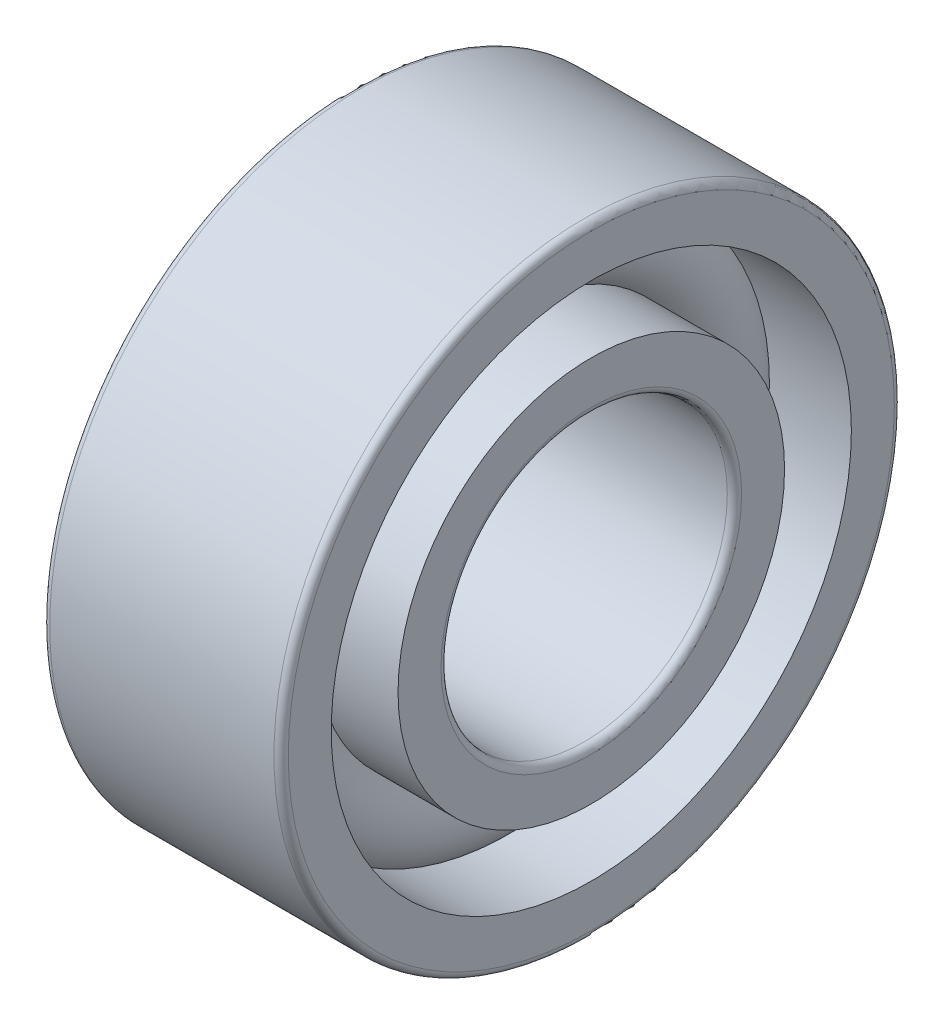
ISO-10303-21;
HEADER;
FILE_DESCRIPTION(('STEP AP214'),'2;1');
FILE_NAME('part.step','',(''),(''),'','','');
FILE_SCHEMA(('AUTOMOTIVE_DESIGN { 1 0 10303 214 1 1 1 1 }'));
ENDSEC;
DATA;
#1=APPLICATION_CONTEXT('core data for automotive mechanical design processes');
#2=APPLICATION_PROTOCOL_DEFINITION('international standard','automotive_design',2000,#1);
#3=PRODUCT_CONTEXT('',#1,'mechanical');
#4=PRODUCT('Part','Part','',(#3));
#5=PRODUCT_RELATED_PRODUCT_CATEGORY('part','',(#4));
#6=PRODUCT_DEFINITION_FORMATION('','',#4);
#7=PRODUCT_DEFINITION_CONTEXT('part definition',#1,'design');
#8=PRODUCT_DEFINITION('design','',#6,#7);
#9=PRODUCT_DEFINITION_SHAPE('','',#8);
#10=(LENGTH_UNIT() NAMED_UNIT(*) SI_UNIT(.MILLI.,.METRE.));
#11=(NAMED_UNIT(*) PLANE_ANGLE_UNIT() SI_UNIT($,.RADIAN.));
#12=(NAMED_UNIT(*) SI_UNIT($,.STERADIAN.) SOLID_ANGLE_UNIT());
#13=UNCERTAINTY_MEASURE_WITH_UNIT(LENGTH_MEASURE(1.E-05),#10,'distance_accuracy_value','');
#14=(GEOMETRIC_REPRESENTATION_CONTEXT(3) GLOBAL_UNCERTAINTY_ASSIGNED_CONTEXT((#13)) GLOBAL_UNIT_ASSIGNED_CONTEXT((#10,
#11,#12)) REPRESENTATION_CONTEXT('',''));
#15=CARTESIAN_POINT('',(0.,0.,0.));
#16=DIRECTION('',(0.,0.,1.));
#17=DIRECTION('',(1.,0.,0.));
#18=AXIS2_PLACEMENT_3D('',#15,#16,#17);
#19=CARTESIAN_POINT('',(0.,0.,0.));
#20=DIRECTION('',(-1.,0.,0.));
#21=DIRECTION('',(0.,0.,1.));
#22=AXIS2_PLACEMENT_3D('',#19,#20,#21);
#23=TOROIDAL_SURFACE('',#22,4.75,1.05);
#24=CARTESIAN_POINT('',(0.782623792124923,0.,0.));
#25=DIRECTION('',(-1.,0.,0.));
#26=DIRECTION('',(0.,0.,1.));
#27=AXIS2_PLACEMENT_3D('',#24,#25,#26);
#28=CIRCLE('',#27,5.45000000000001);
#29=CARTESIAN_POINT('',(0.782623792124923,0.,5.45000000000001));
#30=VERTEX_POINT('',#29);
#31=EDGE_CURVE('E35',#30,#30,#28,.F.);
#32=ORIENTED_EDGE('',*,*,#31,.T.);
#33=EDGE_LOOP('',(#32));
#34=FACE_BOUND('',#33,.T.);
#35=CARTESIAN_POINT('',(0.782623792124924,0.,0.));
#36=DIRECTION('',(-1.,0.,0.));
#37=DIRECTION('',(0.,0.,1.));
#38=AXIS2_PLACEMENT_3D('',#35,#36,#37);
#39=CIRCLE('',#38,4.05);
#40=CARTESIAN_POINT('',(0.782623792124924,0.,4.05));
#41=VERTEX_POINT('',#40);
#42=EDGE_CURVE('E10',#41,#41,#39,.T.);
#43=ORIENTED_EDGE('',*,*,#42,.T.);
#44=EDGE_LOOP('',(#43));
#45=FACE_BOUND('',#44,.T.);
#46=ADVANCED_FACE('F31',(#34,#45),#23,.T.);
#47=CARTESIAN_POINT('',(-20.6375,0.,0.));
#48=DIRECTION('',(1.,0.,0.));
#49=DIRECTION('',(0.,0.,-1.));
#50=AXIS2_PLACEMENT_3D('',#47,#48,#49);
#51=CYLINDRICAL_SURFACE('',#50,4.05);
#52=CARTESIAN_POINT('',(2.5,0.,0.));
#53=DIRECTION('',(1.,0.,0.));
#54=DIRECTION('',(0.,0.,-1.));
#55=AXIS2_PLACEMENT_3D('',#52,#53,#54);
#56=CIRCLE('',#55,4.05);
#57=CARTESIAN_POINT('',(2.5,0.,-4.05));
#58=VERTEX_POINT('',#57);
#59=EDGE_CURVE('E44',#58,#58,#56,.T.);
#60=ORIENTED_EDGE('',*,*,#59,.F.);
#61=EDGE_LOOP('',(#60));
#62=FACE_BOUND('',#61,.T.);
#63=ORIENTED_EDGE('',*,*,#42,.F.);
#64=EDGE_LOOP('',(#63));
#65=FACE_BOUND('',#64,.T.);
#66=ADVANCED_FACE('F83',(#62,#65),#51,.T.);
#67=CARTESIAN_POINT('',(-20.6375,0.,0.));
#68=DIRECTION('',(1.,0.,0.));
#69=DIRECTION('',(0.,0.,-1.));
#70=AXIS2_PLACEMENT_3D('',#67,#68,#69);
#71=CYLINDRICAL_SURFACE('',#70,4.05);
#72=CARTESIAN_POINT('',(-2.5,0.,0.));
#73=DIRECTION('',(1.,0.,0.));
#74=DIRECTION('',(0.,0.,-1.));
#75=AXIS2_PLACEMENT_3D('',#72,#73,#74);
#76=CIRCLE('',#75,4.05);
#77=CARTESIAN_POINT('',(-2.5,0.,-4.05));
#78=VERTEX_POINT('',#77);
#79=EDGE_CURVE('E53',#78,#78,#76,.T.);
#80=ORIENTED_EDGE('',*,*,#79,.T.);
#81=EDGE_LOOP('',(#80));
#82=FACE_BOUND('',#81,.T.);
#83=CARTESIAN_POINT('',(-0.782623792124924,0.,0.));
#84=DIRECTION('',(1.,0.,0.));
#85=DIRECTION('',(0.,0.,-1.));
#86=AXIS2_PLACEMENT_3D('',#83,#84,#85);
#87=CIRCLE('',#86,4.05);
#88=CARTESIAN_POINT('',(-0.782623792124924,0.,-4.05));
#89=VERTEX_POINT('',#88);
#90=EDGE_CURVE('E39',#89,#89,#87,.T.);
#91=ORIENTED_EDGE('',*,*,#90,.F.);
#92=EDGE_LOOP('',(#91));
#93=FACE_BOUND('',#92,.T.);
#94=ADVANCED_FACE('F86',(#82,#93),#71,.T.);
#95=CARTESIAN_POINT('',(2.5,3.15,0.));
#96=DIRECTION('',(1.,0.,0.));
#97=DIRECTION('',(0.,0.,-1.));
#98=AXIS2_PLACEMENT_3D('',#95,#96,#97);
#99=PLANE('',#98);
#100=ORIENTED_EDGE('',*,*,#59,.T.);
#101=EDGE_LOOP('',(#100));
#102=FACE_BOUND('',#101,.T.);
#103=CARTESIAN_POINT('',(2.5,0.,0.));
#104=DIRECTION('',(1.,0.,0.));
#105=DIRECTION('',(0.,0.,-1.));
#106=AXIS2_PLACEMENT_3D('',#103,#104,#105);
#107=CIRCLE('',#106,3.15);
#108=CARTESIAN_POINT('',(2.5,0.,-3.15));
#109=VERTEX_POINT('',#108);
#110=EDGE_CURVE('E75',#109,#109,#107,.T.);
#111=ORIENTED_EDGE('',*,*,#110,.F.);
#112=EDGE_LOOP('',(#111));
#113=FACE_BOUND('',#112,.T.);
#114=ADVANCED_FACE('F80',(#102,#113),#99,.T.);
#115=CARTESIAN_POINT('',(2.35,0.,0.));
#116=DIRECTION('',(1.,0.,0.));
#117=DIRECTION('',(0.,0.,-1.));
#118=AXIS2_PLACEMENT_3D('',#115,#116,#117);
#119=TOROIDAL_SURFACE('',#118,3.15,0.15);
#120=ORIENTED_EDGE('',*,*,#110,.T.);
#121=EDGE_LOOP('',(#120));
#122=FACE_BOUND('',#121,.T.);
#123=CARTESIAN_POINT('',(2.35,0.,0.));
#124=DIRECTION('',(1.,0.,0.));
#125=DIRECTION('',(0.,0.,-1.));
#126=AXIS2_PLACEMENT_3D('',#123,#124,#125);
#127=CIRCLE('',#126,3.);
#128=CARTESIAN_POINT('',(2.35,0.,-3.));
#129=VERTEX_POINT('',#128);
#130=EDGE_CURVE('E72',#129,#129,#127,.T.);
#131=ORIENTED_EDGE('',*,*,#130,.F.);
#132=EDGE_LOOP('',(#131));
#133=FACE_BOUND('',#132,.T.);
#134=ADVANCED_FACE('F97',(#122,#133),#119,.T.);
#135=CARTESIAN_POINT('',(-20.6375,0.,0.));
#136=DIRECTION('',(1.,0.,0.));
#137=DIRECTION('',(0.,0.,-1.));
#138=AXIS2_PLACEMENT_3D('',#135,#136,#137);
#139=CYLINDRICAL_SURFACE('',#138,3.);
#140=ORIENTED_EDGE('',*,*,#130,.T.);
#141=EDGE_LOOP('',(#140));
#142=FACE_BOUND('',#141,.T.);
#143=CARTESIAN_POINT('',(-2.35,0.,0.));
#144=DIRECTION('',(1.,0.,0.));
#145=DIRECTION('',(0.,0.,-1.));
#146=AXIS2_PLACEMENT_3D('',#143,#144,#145);
#147=CIRCLE('',#146,3.);
#148=CARTESIAN_POINT('',(-2.35,0.,-3.));
#149=VERTEX_POINT('',#148);
#150=EDGE_CURVE('E69',#149,#149,#147,.T.);
#151=ORIENTED_EDGE('',*,*,#150,.F.);
#152=EDGE_LOOP('',(#151));
#153=FACE_BOUND('',#152,.T.);
#154=ADVANCED_FACE('F100',(#142,#153),#139,.F.);
#155=CARTESIAN_POINT('',(-2.35,0.,0.));
#156=DIRECTION('',(1.,0.,0.));
#157=DIRECTION('',(0.,0.,-1.));
#158=AXIS2_PLACEMENT_3D('',#155,#156,#157);
#159=TOROIDAL_SURFACE('',#158,3.15,0.15);
#160=ORIENTED_EDGE('',*,*,#150,.T.);
#161=EDGE_LOOP('',(#160));
#162=FACE_BOUND('',#161,.T.);
#163=CARTESIAN_POINT('',(-2.5,0.,0.));
#164=DIRECTION('',(1.,0.,0.));
#165=DIRECTION('',(0.,0.,-1.));
#166=AXIS2_PLACEMENT_3D('',#163,#164,#165);
#167=CIRCLE('',#166,3.15);
#168=CARTESIAN_POINT('',(-2.5,0.,-3.15));
#169=VERTEX_POINT('',#168);
#170=EDGE_CURVE('E66',#169,#169,#167,.T.);
#171=ORIENTED_EDGE('',*,*,#170,.F.);
#172=EDGE_LOOP('',(#171));
#173=FACE_BOUND('',#172,.T.);
#174=ADVANCED_FACE('F104',(#162,#173),#159,.T.);
#175=CARTESIAN_POINT('',(-2.5,4.05,0.));
#176=DIRECTION('',(-1.,0.,0.));
#177=DIRECTION('',(0.,0.,1.));
#178=AXIS2_PLACEMENT_3D('',#175,#176,#177);
#179=PLANE('',#178);
#180=ORIENTED_EDGE('',*,*,#170,.T.);
#181=EDGE_LOOP('',(#180));
#182=FACE_BOUND('',#181,.T.);
#183=ORIENTED_EDGE('',*,*,#79,.F.);
#184=EDGE_LOOP('',(#183));
#185=FACE_BOUND('',#184,.T.);
#186=ADVANCED_FACE('F108',(#182,#185),#179,.T.);
#187=CARTESIAN_POINT('',(-0.782623792124923,0.,0.));
#188=DIRECTION('',(1.,0.,0.));
#189=DIRECTION('',(0.,0.,-1.));
#190=AXIS2_PLACEMENT_3D('',#187,#188,#189);
#191=CIRCLE('',#190,5.45000000000001);
#192=CARTESIAN_POINT('',(-0.782623792124923,0.,-5.45000000000001));
#193=VERTEX_POINT('',#192);
#194=EDGE_CURVE('E47',#193,#193,#191,.F.);
#195=ORIENTED_EDGE('',*,*,#194,.T.);
#196=EDGE_LOOP('',(#195));
#197=FACE_BOUND('',#196,.T.);
#198=ORIENTED_EDGE('',*,*,#90,.T.);
#199=EDGE_LOOP('',(#198));
#200=FACE_BOUND('',#199,.T.);
#201=ADVANCED_FACE('F33',(#197,#200),#23,.T.);
#202=CARTESIAN_POINT('',(-20.6375,0.,0.));
#203=DIRECTION('',(1.,0.,0.));
#204=DIRECTION('',(0.,0.,-1.));
#205=AXIS2_PLACEMENT_3D('',#202,#203,#204);
#206=CYLINDRICAL_SURFACE('',#205,5.45000000000001);
#207=CARTESIAN_POINT('',(2.5,0.,0.));
#208=DIRECTION('',(1.,0.,0.));
#209=DIRECTION('',(0.,0.,-1.));
#210=AXIS2_PLACEMENT_3D('',#207,#208,#209);
#211=CIRCLE('',#210,5.45000000000001);
#212=CARTESIAN_POINT('',(2.5,0.,-5.45000000000001));
#213=VERTEX_POINT('',#212);
#214=EDGE_CURVE('E49',#213,#213,#211,.T.);
#215=ORIENTED_EDGE('',*,*,#214,.T.);
#216=EDGE_LOOP('',(#215));
#217=FACE_BOUND('',#216,.T.);
#218=ORIENTED_EDGE('',*,*,#31,.F.);
#219=EDGE_LOOP('',(#218));
#220=FACE_BOUND('',#219,.T.);
#221=ADVANCED_FACE('F113',(#217,#220),#206,.F.);
#222=CARTESIAN_POINT('',(-20.6375,0.,0.));
#223=DIRECTION('',(1.,0.,0.));
#224=DIRECTION('',(0.,0.,-1.));
#225=AXIS2_PLACEMENT_3D('',#222,#223,#224);
#226=CYLINDRICAL_SURFACE('',#225,5.45000000000001);
#227=CARTESIAN_POINT('',(-2.5,0.,0.));
#228=DIRECTION('',(1.,0.,0.));
#229=DIRECTION('',(0.,0.,-1.));
#230=AXIS2_PLACEMENT_3D('',#227,#228,#229);
#231=CIRCLE('',#230,5.45000000000001);
#232=CARTESIAN_POINT('',(-2.5,0.,-5.45000000000001));
#233=VERTEX_POINT('',#232);
#234=EDGE_CURVE('E144',#233,#233,#231,.T.);
#235=ORIENTED_EDGE('',*,*,#234,.F.);
#236=EDGE_LOOP('',(#235));
#237=FACE_BOUND('',#236,.T.);
#238=ORIENTED_EDGE('',*,*,#194,.F.);
#239=EDGE_LOOP('',(#238));
#240=FACE_BOUND('',#239,.T.);
#241=ADVANCED_FACE('F116',(#237,#240),#226,.F.);
#242=CARTESIAN_POINT('',(2.5,6.35,0.));
#243=DIRECTION('',(1.,0.,0.));
#244=DIRECTION('',(0.,0.,-1.));
#245=AXIS2_PLACEMENT_3D('',#242,#243,#244);
#246=PLANE('',#245);
#247=CARTESIAN_POINT('',(2.5,0.,0.));
#248=DIRECTION('',(1.,0.,0.));
#249=DIRECTION('',(0.,0.,-1.));
#250=AXIS2_PLACEMENT_3D('',#247,#248,#249);
#251=CIRCLE('',#250,6.35);
#252=CARTESIAN_POINT('',(2.5,0.,-6.35));
#253=VERTEX_POINT('',#252);
#254=EDGE_CURVE('E55',#253,#253,#251,.T.);
#255=ORIENTED_EDGE('',*,*,#254,.T.);
#256=EDGE_LOOP('',(#255));
#257=FACE_BOUND('',#256,.T.);
#258=ORIENTED_EDGE('',*,*,#214,.F.);
#259=EDGE_LOOP('',(#258));
#260=FACE_BOUND('',#259,.T.);
#261=ADVANCED_FACE('F117',(#257,#260),#246,.T.);
#262=CARTESIAN_POINT('',(2.35,0.,0.));
#263=DIRECTION('',(1.,0.,0.));
#264=DIRECTION('',(0.,0.,-1.));
#265=AXIS2_PLACEMENT_3D('',#262,#263,#264);
#266=TOROIDAL_SURFACE('',#265,6.35,0.149999999999997);
#267=CARTESIAN_POINT('',(2.35,0.,0.));
#268=DIRECTION('',(1.,0.,0.));
#269=DIRECTION('',(0.,0.,-1.));
#270=AXIS2_PLACEMENT_3D('',#267,#268,#269);
#271=CIRCLE('',#270,6.5);
#272=CARTESIAN_POINT('',(2.35,0.,-6.5));
#273=VERTEX_POINT('',#272);
#274=EDGE_CURVE('E60',#273,#273,#271,.T.);
#275=ORIENTED_EDGE('',*,*,#274,.T.);
#276=EDGE_LOOP('',(#275));
#277=FACE_BOUND('',#276,.T.);
#278=ORIENTED_EDGE('',*,*,#254,.F.);
#279=EDGE_LOOP('',(#278));
#280=FACE_BOUND('',#279,.T.);
#281=ADVANCED_FACE('F120',(#277,#280),#266,.T.);
#282=CARTESIAN_POINT('',(-20.6375,0.,0.));
#283=DIRECTION('',(1.,0.,0.));
#284=DIRECTION('',(0.,0.,-1.));
#285=AXIS2_PLACEMENT_3D('',#282,#283,#284);
#286=CYLINDRICAL_SURFACE('',#285,6.5);
#287=CARTESIAN_POINT('',(-2.35,0.,0.));
#288=DIRECTION('',(1.,0.,0.));
#289=DIRECTION('',(0.,0.,-1.));
#290=AXIS2_PLACEMENT_3D('',#287,#288,#289);
#291=CIRCLE('',#290,6.5);
#292=CARTESIAN_POINT('',(-2.35,0.,-6.5));
#293=VERTEX_POINT('',#292);
#294=EDGE_CURVE('E148',#293,#293,#291,.T.);
#295=ORIENTED_EDGE('',*,*,#294,.T.);
#296=EDGE_LOOP('',(#295));
#297=FACE_BOUND('',#296,.T.);
#298=ORIENTED_EDGE('',*,*,#274,.F.);
#299=EDGE_LOOP('',(#298));
#300=FACE_BOUND('',#299,.T.);
#301=ADVANCED_FACE('F124',(#297,#300),#286,.T.);
#302=CARTESIAN_POINT('',(-2.35,0.,0.));
#303=DIRECTION('',(1.,0.,0.));
#304=DIRECTION('',(0.,0.,-1.));
#305=AXIS2_PLACEMENT_3D('',#302,#303,#304);
#306=TOROIDAL_SURFACE('',#305,6.35,0.149999999999997);
#307=CARTESIAN_POINT('',(-2.5,0.,0.));
#308=DIRECTION('',(1.,0.,0.));
#309=DIRECTION('',(0.,0.,-1.));
#310=AXIS2_PLACEMENT_3D('',#307,#308,#309);
#311=CIRCLE('',#310,6.35);
#312=CARTESIAN_POINT('',(-2.5,0.,-6.35));
#313=VERTEX_POINT('',#312);
#314=EDGE_CURVE('E145',#313,#313,#311,.T.);
#315=ORIENTED_EDGE('',*,*,#314,.T.);
#316=EDGE_LOOP('',(#315));
#317=FACE_BOUND('',#316,.T.);
#318=ORIENTED_EDGE('',*,*,#294,.F.);
#319=EDGE_LOOP('',(#318));
#320=FACE_BOUND('',#319,.T.);
#321=ADVANCED_FACE('F128',(#317,#320),#306,.T.);
#322=CARTESIAN_POINT('',(-2.5,5.45000000000001,0.));
#323=DIRECTION('',(-1.,0.,0.));
#324=DIRECTION('',(0.,0.,1.));
#325=AXIS2_PLACEMENT_3D('',#322,#323,#324);
#326=PLANE('',#325);
#327=ORIENTED_EDGE('',*,*,#234,.T.);
#328=EDGE_LOOP('',(#327));
#329=FACE_BOUND('',#328,.T.);
#330=ORIENTED_EDGE('',*,*,#314,.F.);
#331=EDGE_LOOP('',(#330));
#332=FACE_BOUND('',#331,.T.);
#333=ADVANCED_FACE('F132',(#329,#332),#326,.T.);
#334=CLOSED_SHELL('',(#46,#66,#94,#114,#134,#154,#174,#186,#201,#221,#241,#261,#281,#301,#321,#333));
#335=MANIFOLD_SOLID_BREP('B2',#334);
#336=ADVANCED_BREP_SHAPE_REPRESENTATION('',(#18,#335),#14);
#337=SHAPE_DEFINITION_REPRESENTATION(#9,#336);
ENDSEC;
END-ISO-10303-21;
